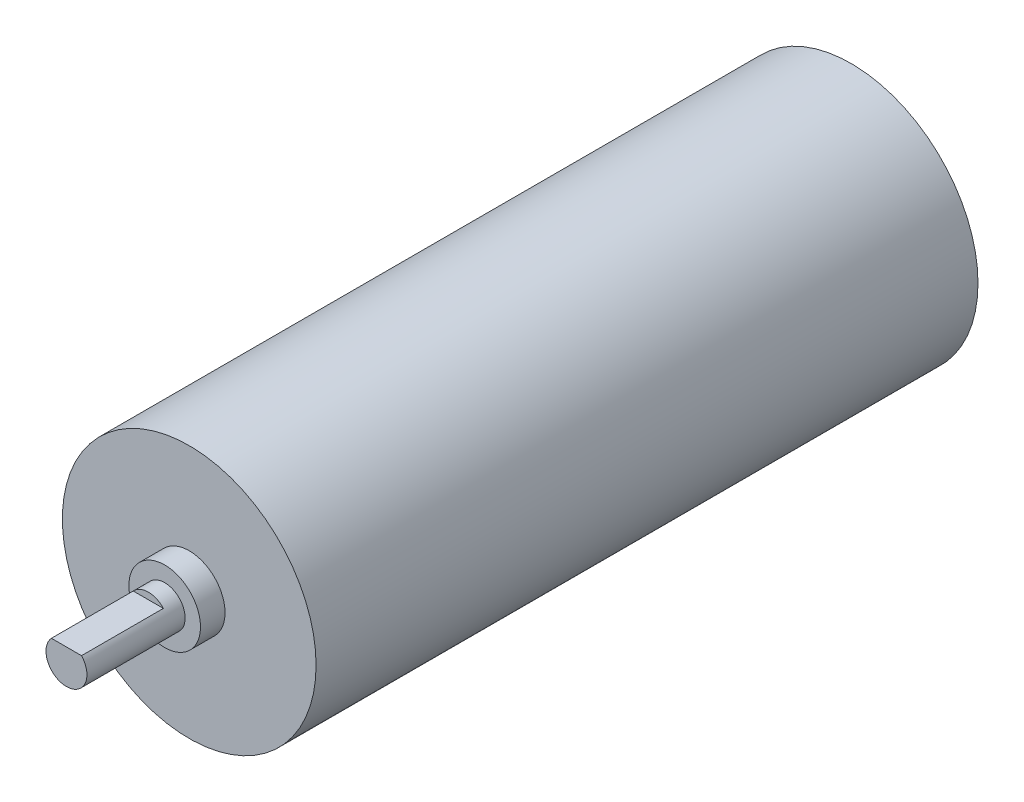
ISO-10303-21;
HEADER;
FILE_DESCRIPTION(('STEP AP214'),'2;1');
FILE_NAME('part.step','',(''),(''),'','','');
FILE_SCHEMA(('AUTOMOTIVE_DESIGN { 1 0 10303 214 1 1 1 1 }'));
ENDSEC;
DATA;
#1=APPLICATION_CONTEXT('core data for automotive mechanical design processes');
#2=APPLICATION_PROTOCOL_DEFINITION('international standard','automotive_design',2000,#1);
#3=PRODUCT_CONTEXT('',#1,'mechanical');
#4=PRODUCT('Part','Part','',(#3));
#5=PRODUCT_RELATED_PRODUCT_CATEGORY('part','',(#4));
#6=PRODUCT_DEFINITION_FORMATION('','',#4);
#7=PRODUCT_DEFINITION_CONTEXT('part definition',#1,'design');
#8=PRODUCT_DEFINITION('design','',#6,#7);
#9=PRODUCT_DEFINITION_SHAPE('','',#8);
#10=(LENGTH_UNIT() NAMED_UNIT(*) SI_UNIT(.MILLI.,.METRE.));
#11=(NAMED_UNIT(*) PLANE_ANGLE_UNIT() SI_UNIT($,.RADIAN.));
#12=(NAMED_UNIT(*) SI_UNIT($,.STERADIAN.) SOLID_ANGLE_UNIT());
#13=UNCERTAINTY_MEASURE_WITH_UNIT(LENGTH_MEASURE(1.E-05),#10,'distance_accuracy_value','');
#14=(GEOMETRIC_REPRESENTATION_CONTEXT(3) GLOBAL_UNCERTAINTY_ASSIGNED_CONTEXT((#13)) GLOBAL_UNIT_ASSIGNED_CONTEXT((#10,
#11,#12)) REPRESENTATION_CONTEXT('',''));
#15=CARTESIAN_POINT('',(0.,0.,0.));
#16=DIRECTION('',(0.,0.,1.));
#17=DIRECTION('',(1.,0.,0.));
#18=AXIS2_PLACEMENT_3D('',#15,#16,#17);
#19=CARTESIAN_POINT('',(0.,0.,64.7));
#20=DIRECTION('',(0.,0.,-1.));
#21=DIRECTION('',(-1.,0.,0.));
#22=AXIS2_PLACEMENT_3D('',#19,#20,#21);
#23=CYLINDRICAL_SURFACE('',#22,12.4);
#24=CARTESIAN_POINT('',(0.,0.,64.7));
#25=DIRECTION('',(0.,0.,1.));
#26=DIRECTION('',(1.,0.,0.));
#27=AXIS2_PLACEMENT_3D('',#24,#25,#26);
#28=CIRCLE('',#27,12.4);
#29=CARTESIAN_POINT('',(12.4,0.,64.7));
#30=VERTEX_POINT('',#29);
#31=EDGE_CURVE('E81',#30,#30,#28,.T.);
#32=ORIENTED_EDGE('',*,*,#31,.F.);
#33=EDGE_LOOP('',(#32));
#34=FACE_BOUND('',#33,.T.);
#35=CARTESIAN_POINT('',(0.,0.,0.));
#36=DIRECTION('',(0.,0.,1.));
#37=DIRECTION('',(1.,0.,0.));
#38=AXIS2_PLACEMENT_3D('',#35,#36,#37);
#39=CIRCLE('',#38,12.4);
#40=CARTESIAN_POINT('',(12.4,0.,0.));
#41=VERTEX_POINT('',#40);
#42=EDGE_CURVE('E36',#41,#41,#39,.T.);
#43=ORIENTED_EDGE('',*,*,#42,.T.);
#44=EDGE_LOOP('',(#43));
#45=FACE_BOUND('',#44,.T.);
#46=ADVANCED_FACE('F33',(#34,#45),#23,.T.);
#47=CARTESIAN_POINT('',(0.,0.,64.7));
#48=DIRECTION('',(0.,0.,1.));
#49=DIRECTION('',(1.,0.,0.));
#50=AXIS2_PLACEMENT_3D('',#47,#48,#49);
#51=PLANE('',#50);
#52=CARTESIAN_POINT('',(0.,0.,64.7));
#53=DIRECTION('',(0.,0.,1.));
#54=DIRECTION('',(1.,0.,0.));
#55=AXIS2_PLACEMENT_3D('',#52,#53,#54);
#56=CIRCLE('',#55,3.5);
#57=CARTESIAN_POINT('',(3.5,0.,64.7));
#58=VERTEX_POINT('',#57);
#59=EDGE_CURVE('E41',#58,#58,#56,.T.);
#60=ORIENTED_EDGE('',*,*,#59,.F.);
#61=EDGE_LOOP('',(#60));
#62=FACE_BOUND('',#61,.T.);
#63=ORIENTED_EDGE('',*,*,#31,.T.);
#64=EDGE_LOOP('',(#63));
#65=FACE_BOUND('',#64,.T.);
#66=ADVANCED_FACE('F92',(#62,#65),#51,.T.);
#67=CARTESIAN_POINT('',(0.,0.,0.));
#68=DIRECTION('',(0.,0.,1.));
#69=DIRECTION('',(1.,0.,0.));
#70=AXIS2_PLACEMENT_3D('',#67,#68,#69);
#71=PLANE('',#70);
#72=ORIENTED_EDGE('',*,*,#42,.F.);
#73=EDGE_LOOP('',(#72));
#74=FACE_BOUND('',#73,.T.);
#75=ADVANCED_FACE('F89',(#74),#71,.F.);
#76=CARTESIAN_POINT('',(0.,0.,67.1));
#77=DIRECTION('',(0.,0.,-1.));
#78=DIRECTION('',(-1.,0.,0.));
#79=AXIS2_PLACEMENT_3D('',#76,#77,#78);
#80=CYLINDRICAL_SURFACE('',#79,3.5);
#81=CARTESIAN_POINT('',(0.,0.,67.1));
#82=DIRECTION('',(0.,0.,1.));
#83=DIRECTION('',(1.,0.,0.));
#84=AXIS2_PLACEMENT_3D('',#81,#82,#83);
#85=CIRCLE('',#84,3.5);
#86=CARTESIAN_POINT('',(3.5,0.,67.1));
#87=VERTEX_POINT('',#86);
#88=EDGE_CURVE('E74',#87,#87,#85,.T.);
#89=ORIENTED_EDGE('',*,*,#88,.F.);
#90=EDGE_LOOP('',(#89));
#91=FACE_BOUND('',#90,.T.);
#92=ORIENTED_EDGE('',*,*,#59,.T.);
#93=EDGE_LOOP('',(#92));
#94=FACE_BOUND('',#93,.T.);
#95=ADVANCED_FACE('F91',(#91,#94),#80,.T.);
#96=CARTESIAN_POINT('',(0.,0.,67.1));
#97=DIRECTION('',(0.,0.,1.));
#98=DIRECTION('',(1.,0.,0.));
#99=AXIS2_PLACEMENT_3D('',#96,#97,#98);
#100=PLANE('',#99);
#101=CARTESIAN_POINT('',(0.,0.,67.1));
#102=DIRECTION('',(0.,0.,1.));
#103=DIRECTION('',(1.,0.,0.));
#104=AXIS2_PLACEMENT_3D('',#101,#102,#103);
#105=CIRCLE('',#104,2.);
#106=CARTESIAN_POINT('',(2.,0.,67.1));
#107=VERTEX_POINT('',#106);
#108=EDGE_CURVE('E11',#107,#107,#105,.T.);
#109=ORIENTED_EDGE('',*,*,#108,.F.);
#110=EDGE_LOOP('',(#109));
#111=FACE_BOUND('',#110,.T.);
#112=ORIENTED_EDGE('',*,*,#88,.T.);
#113=EDGE_LOOP('',(#112));
#114=FACE_BOUND('',#113,.T.);
#115=ADVANCED_FACE('F97',(#111,#114),#100,.T.);
#116=CARTESIAN_POINT('',(0.,0.,76.7));
#117=DIRECTION('',(0.,0.,-1.));
#118=DIRECTION('',(-1.,0.,0.));
#119=AXIS2_PLACEMENT_3D('',#116,#117,#118);
#120=CYLINDRICAL_SURFACE('',#119,2.);
#121=CARTESIAN_POINT('',(0.,0.,76.7));
#122=DIRECTION('',(0.,0.,1.));
#123=DIRECTION('',(1.,0.,0.));
#124=AXIS2_PLACEMENT_3D('',#121,#122,#123);
#125=CIRCLE('',#124,2.);
#126=CARTESIAN_POINT('',(-1.47208684365,1.35386865121864,76.7));
#127=VERTEX_POINT('',#126);
#128=CARTESIAN_POINT('',(1.47208684365,1.35386865121864,76.7));
#129=VERTEX_POINT('',#128);
#130=EDGE_CURVE('E71',#127,#129,#125,.T.);
#131=ORIENTED_EDGE('',*,*,#130,.F.);
#132=DIRECTION('',(0.,0.,1.));
#133=VECTOR('',#132,1.);
#134=CARTESIAN_POINT('',(-1.47208684365,1.35386865121864,68.7));
#135=LINE('',#134,#133);
#136=CARTESIAN_POINT('',(-1.47208684365,1.35386865121864,68.7));
#137=VERTEX_POINT('',#136);
#138=EDGE_CURVE('E49',#137,#127,#135,.T.);
#139=ORIENTED_EDGE('',*,*,#138,.F.);
#140=CARTESIAN_POINT('',(0.,0.,68.7));
#141=DIRECTION('',(0.,0.,1.));
#142=DIRECTION('',(1.,0.,0.));
#143=AXIS2_PLACEMENT_3D('',#140,#141,#142);
#144=CIRCLE('',#143,2.);
#145=CARTESIAN_POINT('',(1.47208684365,1.35386865121864,68.7));
#146=VERTEX_POINT('',#145);
#147=EDGE_CURVE('E65',#146,#137,#144,.T.);
#148=ORIENTED_EDGE('',*,*,#147,.F.);
#149=DIRECTION('',(0.,0.,1.));
#150=VECTOR('',#149,1.);
#151=CARTESIAN_POINT('',(1.47208684365,1.35386865121864,68.7));
#152=LINE('',#151,#150);
#153=EDGE_CURVE('E55',#146,#129,#152,.T.);
#154=ORIENTED_EDGE('',*,*,#153,.T.);
#155=EDGE_LOOP('',(#131,#139,#148,#154));
#156=FACE_BOUND('',#155,.T.);
#157=ORIENTED_EDGE('',*,*,#108,.T.);
#158=EDGE_LOOP('',(#157));
#159=FACE_BOUND('',#158,.T.);
#160=ADVANCED_FACE('F69',(#156,#159),#120,.T.);
#161=CARTESIAN_POINT('',(0.,0.,76.7));
#162=DIRECTION('',(0.,0.,1.));
#163=DIRECTION('',(1.,0.,0.));
#164=AXIS2_PLACEMENT_3D('',#161,#162,#163);
#165=PLANE('',#164);
#166=DIRECTION('',(1.,0.,0.));
#167=VECTOR('',#166,1.);
#168=CARTESIAN_POINT('',(-1.47208684365,1.35386865121864,76.7));
#169=LINE('',#168,#167);
#170=EDGE_CURVE('E60',#127,#129,#169,.T.);
#171=ORIENTED_EDGE('',*,*,#170,.F.);
#172=ORIENTED_EDGE('',*,*,#130,.T.);
#173=EDGE_LOOP('',(#171,#172));
#174=FACE_BOUND('',#173,.T.);
#175=ADVANCED_FACE('F73',(#174),#165,.T.);
#176=CARTESIAN_POINT('',(-1.47208684365,1.35386865121864,68.7));
#177=DIRECTION('',(0.,-1.,0.));
#178=DIRECTION('',(0.,0.,-1.));
#179=AXIS2_PLACEMENT_3D('',#176,#177,#178);
#180=PLANE('',#179);
#181=ORIENTED_EDGE('',*,*,#170,.T.);
#182=ORIENTED_EDGE('',*,*,#153,.F.);
#183=DIRECTION('',(1.,0.,0.));
#184=VECTOR('',#183,1.);
#185=CARTESIAN_POINT('',(-1.47208684365,1.35386865121864,68.7));
#186=LINE('',#185,#184);
#187=EDGE_CURVE('E161',#137,#146,#186,.T.);
#188=ORIENTED_EDGE('',*,*,#187,.F.);
#189=ORIENTED_EDGE('',*,*,#138,.T.);
#190=EDGE_LOOP('',(#181,#182,#188,#189));
#191=FACE_BOUND('',#190,.T.);
#192=ADVANCED_FACE('F61',(#191),#180,.F.);
#193=CARTESIAN_POINT('',(0.,0.,68.7));
#194=DIRECTION('',(0.,0.,1.));
#195=DIRECTION('',(1.,0.,0.));
#196=AXIS2_PLACEMENT_3D('',#193,#194,#195);
#197=PLANE('',#196);
#198=ORIENTED_EDGE('',*,*,#147,.T.);
#199=ORIENTED_EDGE('',*,*,#187,.T.);
#200=EDGE_LOOP('',(#198,#199));
#201=FACE_BOUND('',#200,.T.);
#202=ADVANCED_FACE('F148',(#201),#197,.T.);
#203=CLOSED_SHELL('',(#46,#66,#75,#95,#115,#160,#175,#192,#202));
#204=MANIFOLD_SOLID_BREP('B2',#203);
#205=ADVANCED_BREP_SHAPE_REPRESENTATION('',(#18,#204),#14);
#206=SHAPE_DEFINITION_REPRESENTATION(#9,#205);
ENDSEC;
END-ISO-10303-21;
